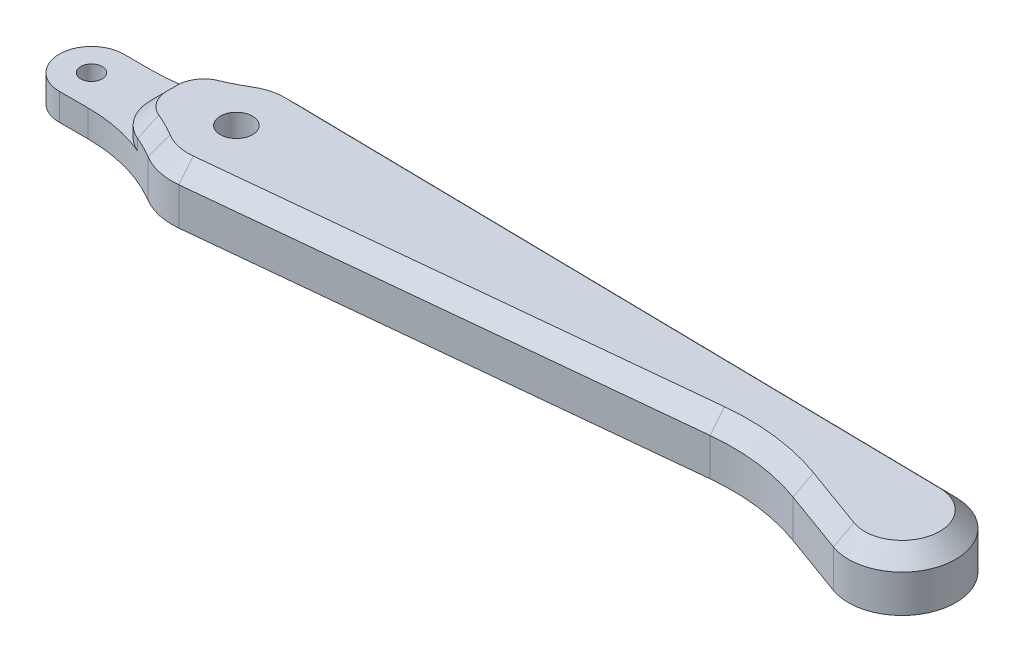
ISO-10303-21;
HEADER;
FILE_DESCRIPTION(('STEP AP214'),'2;1');
FILE_NAME('part.step','',(''),(''),'','','');
FILE_SCHEMA(('AUTOMOTIVE_DESIGN { 1 0 10303 214 1 1 1 1 }'));
ENDSEC;
DATA;
#1=APPLICATION_CONTEXT('core data for automotive mechanical design processes');
#2=APPLICATION_PROTOCOL_DEFINITION('international standard','automotive_design',2000,#1);
#3=PRODUCT_CONTEXT('',#1,'mechanical');
#4=PRODUCT('Part','Part','',(#3));
#5=PRODUCT_RELATED_PRODUCT_CATEGORY('part','',(#4));
#6=PRODUCT_DEFINITION_FORMATION('','',#4);
#7=PRODUCT_DEFINITION_CONTEXT('part definition',#1,'design');
#8=PRODUCT_DEFINITION('design','',#6,#7);
#9=PRODUCT_DEFINITION_SHAPE('','',#8);
#10=(LENGTH_UNIT() NAMED_UNIT(*) SI_UNIT(.MILLI.,.METRE.));
#11=(NAMED_UNIT(*) PLANE_ANGLE_UNIT() SI_UNIT($,.RADIAN.));
#12=(NAMED_UNIT(*) SI_UNIT($,.STERADIAN.) SOLID_ANGLE_UNIT());
#13=UNCERTAINTY_MEASURE_WITH_UNIT(LENGTH_MEASURE(1.E-05),#10,'distance_accuracy_value','');
#14=(GEOMETRIC_REPRESENTATION_CONTEXT(3) GLOBAL_UNCERTAINTY_ASSIGNED_CONTEXT((#13)) GLOBAL_UNIT_ASSIGNED_CONTEXT((#10,
#11,#12)) REPRESENTATION_CONTEXT('',''));
#15=CARTESIAN_POINT('',(0.,0.,0.));
#16=DIRECTION('',(0.,0.,1.));
#17=DIRECTION('',(1.,0.,0.));
#18=AXIS2_PLACEMENT_3D('',#15,#16,#17);
#19=CARTESIAN_POINT('',(-13.5,5.,0.));
#20=DIRECTION('',(0.,-1.,0.));
#21=DIRECTION('',(0.,0.,-1.));
#22=AXIS2_PLACEMENT_3D('',#19,#20,#21);
#23=CYLINDRICAL_SURFACE('',#22,3.);
#24=CARTESIAN_POINT('',(-13.5,2.5,0.));
#25=DIRECTION('',(0.,1.,0.));
#26=DIRECTION('',(0.,0.,1.));
#27=AXIS2_PLACEMENT_3D('',#24,#25,#26);
#28=CIRCLE('',#27,3.);
#29=CARTESIAN_POINT('',(-13.5,2.5,-3.));
#30=VERTEX_POINT('',#29);
#31=CARTESIAN_POINT('',(-13.5,2.5,3.));
#32=VERTEX_POINT('',#31);
#33=EDGE_CURVE('E194',#30,#32,#28,.T.);
#34=ORIENTED_EDGE('',*,*,#33,.F.);
#35=DIRECTION('',(0.,-1.,0.));
#36=VECTOR('',#35,1.);
#37=CARTESIAN_POINT('',(-13.5,5.,-3.));
#38=LINE('',#37,#36);
#39=CARTESIAN_POINT('',(-13.5,0.,-3.));
#40=VERTEX_POINT('',#39);
#41=EDGE_CURVE('E209',#30,#40,#38,.T.);
#42=ORIENTED_EDGE('',*,*,#41,.T.);
#43=CARTESIAN_POINT('',(-13.5,0.,0.));
#44=DIRECTION('',(0.,1.,0.));
#45=DIRECTION('',(0.,0.,1.));
#46=AXIS2_PLACEMENT_3D('',#43,#44,#45);
#47=CIRCLE('',#46,3.);
#48=CARTESIAN_POINT('',(-13.5,0.,3.));
#49=VERTEX_POINT('',#48);
#50=EDGE_CURVE('E396',#40,#49,#47,.T.);
#51=ORIENTED_EDGE('',*,*,#50,.T.);
#52=DIRECTION('',(0.,-1.,0.));
#53=VECTOR('',#52,1.);
#54=CARTESIAN_POINT('',(-13.5,5.,3.));
#55=LINE('',#54,#53);
#56=EDGE_CURVE('E211',#32,#49,#55,.T.);
#57=ORIENTED_EDGE('',*,*,#56,.F.);
#58=EDGE_LOOP('',(#34,#42,#51,#57));
#59=FACE_BOUND('',#58,.T.);
#60=ADVANCED_FACE('F41',(#59),#23,.T.);
#61=CARTESIAN_POINT('',(-13.5,5.,0.));
#62=DIRECTION('',(0.,-1.,0.));
#63=DIRECTION('',(0.,0.,-1.));
#64=AXIS2_PLACEMENT_3D('',#61,#62,#63);
#65=CYLINDRICAL_SURFACE('',#64,1.);
#66=CARTESIAN_POINT('',(-13.5,0.,0.));
#67=DIRECTION('',(0.,1.,0.));
#68=DIRECTION('',(0.,0.,1.));
#69=AXIS2_PLACEMENT_3D('',#66,#67,#68);
#70=CIRCLE('',#69,1.);
#71=CARTESIAN_POINT('',(-13.5,0.,1.));
#72=VERTEX_POINT('',#71);
#73=EDGE_CURVE('E240',#72,#72,#70,.T.);
#74=ORIENTED_EDGE('',*,*,#73,.F.);
#75=EDGE_LOOP('',(#74));
#76=FACE_BOUND('',#75,.T.);
#77=CARTESIAN_POINT('',(-13.5,2.5,0.));
#78=DIRECTION('',(0.,1.,0.));
#79=DIRECTION('',(0.,0.,1.));
#80=AXIS2_PLACEMENT_3D('',#77,#78,#79);
#81=CIRCLE('',#80,1.);
#82=CARTESIAN_POINT('',(-13.5,2.5,1.));
#83=VERTEX_POINT('',#82);
#84=EDGE_CURVE('E202',#83,#83,#81,.T.);
#85=ORIENTED_EDGE('',*,*,#84,.T.);
#86=EDGE_LOOP('',(#85));
#87=FACE_BOUND('',#86,.T.);
#88=ADVANCED_FACE('F494',(#76,#87),#65,.F.);
#89=CARTESIAN_POINT('',(0.,5.,0.));
#90=DIRECTION('',(0.,1.,0.));
#91=DIRECTION('',(0.,0.,1.));
#92=AXIS2_PLACEMENT_3D('',#89,#90,#91);
#93=PLANE('',#92);
#94=DIRECTION('',(0.,0.,1.));
#95=VECTOR('',#94,1.);
#96=CARTESIAN_POINT('',(-6.,5.,0.465275115225112));
#97=LINE('',#96,#95);
#98=CARTESIAN_POINT('',(-6.,5.,-0.465275115225112));
#99=VERTEX_POINT('',#98);
#100=CARTESIAN_POINT('',(-6.,5.,0.465275115225112));
#101=VERTEX_POINT('',#100);
#102=EDGE_CURVE('E289',#99,#101,#97,.T.);
#103=ORIENTED_EDGE('',*,*,#102,.T.);
#104=CARTESIAN_POINT('',(-3.5,5.,0.465275115225112));
#105=DIRECTION('',(0.,1.,0.));
#106=DIRECTION('',(0.,0.,1.));
#107=AXIS2_PLACEMENT_3D('',#104,#105,#106);
#108=CIRCLE('',#107,2.5);
#109=CARTESIAN_POINT('',(-4.46271760873579,5.,2.77247575795865));
#110=VERTEX_POINT('',#109);
#111=EDGE_CURVE('E293',#101,#110,#108,.T.);
#112=ORIENTED_EDGE('',*,*,#111,.T.);
#113=CARTESIAN_POINT('',(-10.816653826392,5.,18.));
#114=DIRECTION('',(0.,1.,0.));
#115=DIRECTION('',(0.,0.,1.));
#116=AXIS2_PLACEMENT_3D('',#113,#114,#115);
#117=CIRCLE('',#116,16.5);
#118=CARTESIAN_POINT('',(-2.31785439136971,5.,3.85714285714286));
#119=VERTEX_POINT('',#118);
#120=EDGE_CURVE('E291',#110,#119,#117,.F.);
#121=ORIENTED_EDGE('',*,*,#120,.T.);
#122=CARTESIAN_POINT('',(0.,5.,0.));
#123=DIRECTION('',(0.,1.,0.));
#124=DIRECTION('',(0.,0.,1.));
#125=AXIS2_PLACEMENT_3D('',#122,#123,#124);
#126=CIRCLE('',#125,4.5);
#127=CARTESIAN_POINT('',(0.45,5.,4.47744346697979));
#128=VERTEX_POINT('',#127);
#129=EDGE_CURVE('E287',#119,#128,#126,.T.);
#130=ORIENTED_EDGE('',*,*,#129,.T.);
#131=DIRECTION('',(0.99498743710662,0.,-0.1));
#132=VECTOR('',#131,1.);
#133=CARTESIAN_POINT('',(45.408314025328,5.,-0.0410371035955315));
#134=LINE('',#133,#132);
#135=CARTESIAN_POINT('',(45.408314025328,5.,-0.041037103595535));
#136=VERTEX_POINT('',#135);
#137=EDGE_CURVE('E283',#128,#136,#134,.T.);
#138=ORIENTED_EDGE('',*,*,#137,.T.);
#139=CARTESIAN_POINT('',(47.558314025328,5.,21.3511927941968));
#140=DIRECTION('',(0.,1.,0.));
#141=DIRECTION('',(0.,0.,1.));
#142=AXIS2_PLACEMENT_3D('',#139,#140,#141);
#143=CIRCLE('',#142,21.5);
#144=CARTESIAN_POINT('',(54.9023890577915,5.,1.14439784998199));
#145=VERTEX_POINT('',#144);
#146=EDGE_CURVE('E279',#136,#145,#143,.F.);
#147=ORIENTED_EDGE('',*,*,#146,.T.);
#148=DIRECTION('',(0.939850927637898,0.,0.341584885230865));
#149=VECTOR('',#148,1.);
#150=CARTESIAN_POINT('',(60.804452901692,5.,3.28947824673263));
#151=LINE('',#150,#149);
#152=CARTESIAN_POINT('',(60.804452901692,5.,3.28947824673264));
#153=VERTEX_POINT('',#152);
#154=EDGE_CURVE('E275',#145,#153,#151,.T.);
#155=ORIENTED_EDGE('',*,*,#154,.T.);
#156=CARTESIAN_POINT('',(62.,5.,0.));
#157=DIRECTION('',(0.,1.,0.));
#158=DIRECTION('',(0.,0.,1.));
#159=AXIS2_PLACEMENT_3D('',#156,#157,#158);
#160=CIRCLE('',#159,3.5);
#161=CARTESIAN_POINT('',(62.0564512737569,5.,-3.49954472091603));
#162=VERTEX_POINT('',#161);
#163=EDGE_CURVE('E271',#153,#162,#160,.T.);
#164=ORIENTED_EDGE('',*,*,#163,.T.);
#165=DIRECTION('',(-0.999869920261722,0.,-0.0161289353591094));
#166=VECTOR('',#165,1.);
#167=CARTESIAN_POINT('',(0.0810697548560727,5.,-4.49927168751269));
#168=LINE('',#167,#166);
#169=CARTESIAN_POINT('',(0.0789473441964594,5.,-4.49930592419052));
#170=VERTEX_POINT('',#169);
#171=EDGE_CURVE('E273',#162,#170,#168,.T.);
#172=ORIENTED_EDGE('',*,*,#171,.T.);
#173=CARTESIAN_POINT('',(0.,5.,0.));
#174=DIRECTION('',(0.,1.,0.));
#175=DIRECTION('',(0.,0.,1.));
#176=AXIS2_PLACEMENT_3D('',#173,#174,#175);
#177=CIRCLE('',#176,4.5);
#178=CARTESIAN_POINT('',(-2.31785439136971,5.,-3.85714285714286));
#179=VERTEX_POINT('',#178);
#180=EDGE_CURVE('E277',#170,#179,#177,.T.);
#181=ORIENTED_EDGE('',*,*,#180,.T.);
#182=CARTESIAN_POINT('',(-10.816653826392,5.,-18.));
#183=DIRECTION('',(0.,1.,0.));
#184=DIRECTION('',(0.,0.,1.));
#185=AXIS2_PLACEMENT_3D('',#182,#183,#184);
#186=CIRCLE('',#185,16.5);
#187=CARTESIAN_POINT('',(-4.46271760873578,5.,-2.77247575795865));
#188=VERTEX_POINT('',#187);
#189=EDGE_CURVE('E281',#179,#188,#186,.F.);
#190=ORIENTED_EDGE('',*,*,#189,.T.);
#191=CARTESIAN_POINT('',(-3.5,5.,-0.465275115225112));
#192=DIRECTION('',(0.,1.,0.));
#193=DIRECTION('',(0.,0.,1.));
#194=AXIS2_PLACEMENT_3D('',#191,#192,#193);
#195=CIRCLE('',#194,2.5);
#196=EDGE_CURVE('E285',#188,#99,#195,.T.);
#197=ORIENTED_EDGE('',*,*,#196,.T.);
#198=EDGE_LOOP('',(#103,#112,#121,#130,#138,#147,#155,#164,#172,#181,#190,#197));
#199=FACE_BOUND('',#198,.T.);
#200=CARTESIAN_POINT('',(0.,5.,0.));
#201=DIRECTION('',(0.,1.,0.));
#202=DIRECTION('',(0.,0.,1.));
#203=AXIS2_PLACEMENT_3D('',#200,#201,#202);
#204=CIRCLE('',#203,1.5);
#205=CARTESIAN_POINT('',(0.,5.,1.5));
#206=VERTEX_POINT('',#205);
#207=EDGE_CURVE('E426',#206,#206,#204,.T.);
#208=ORIENTED_EDGE('',*,*,#207,.F.);
#209=EDGE_LOOP('',(#208));
#210=FACE_BOUND('',#209,.T.);
#211=ADVANCED_FACE('F499',(#199,#210),#93,.T.);
#212=CARTESIAN_POINT('',(0.,0.,0.));
#213=DIRECTION('',(0.,1.,0.));
#214=DIRECTION('',(0.,0.,1.));
#215=AXIS2_PLACEMENT_3D('',#212,#213,#214);
#216=PLANE('',#215);
#217=CARTESIAN_POINT('',(0.,0.,0.));
#218=DIRECTION('',(0.,1.,0.));
#219=DIRECTION('',(0.,0.,1.));
#220=AXIS2_PLACEMENT_3D('',#217,#218,#219);
#221=CIRCLE('',#220,6.);
#222=CARTESIAN_POINT('',(-3.09047252182628,0.,5.14285714285715));
#223=VERTEX_POINT('',#222);
#224=CARTESIAN_POINT('',(0.6,0.,5.96992462263972));
#225=VERTEX_POINT('',#224);
#226=EDGE_CURVE('E386',#223,#225,#221,.T.);
#227=ORIENTED_EDGE('',*,*,#226,.F.);
#228=CARTESIAN_POINT('',(-10.816653826392,0.,18.));
#229=DIRECTION('',(0.,1.,0.));
#230=DIRECTION('',(0.,0.,1.));
#231=AXIS2_PLACEMENT_3D('',#228,#229,#230);
#232=CIRCLE('',#231,15.);
#233=CARTESIAN_POINT('',(-10.816653826392,0.,3.));
#234=VERTEX_POINT('',#233);
#235=EDGE_CURVE('E249',#223,#234,#232,.T.);
#236=ORIENTED_EDGE('',*,*,#235,.T.);
#237=DIRECTION('',(1.,0.,0.));
#238=VECTOR('',#237,1.);
#239=CARTESIAN_POINT('',(-13.5,0.,3.));
#240=LINE('',#239,#238);
#241=EDGE_CURVE('E221',#49,#234,#240,.T.);
#242=ORIENTED_EDGE('',*,*,#241,.F.);
#243=ORIENTED_EDGE('',*,*,#50,.F.);
#244=DIRECTION('',(-1.,0.,0.));
#245=VECTOR('',#244,1.);
#246=CARTESIAN_POINT('',(-13.5,0.,-3.));
#247=LINE('',#246,#245);
#248=CARTESIAN_POINT('',(-10.816653826392,0.,-3.));
#249=VERTEX_POINT('',#248);
#250=EDGE_CURVE('E216',#249,#40,#247,.T.);
#251=ORIENTED_EDGE('',*,*,#250,.F.);
#252=CARTESIAN_POINT('',(-10.816653826392,0.,-18.));
#253=DIRECTION('',(0.,1.,0.));
#254=DIRECTION('',(0.,0.,1.));
#255=AXIS2_PLACEMENT_3D('',#252,#253,#254);
#256=CIRCLE('',#255,15.);
#257=CARTESIAN_POINT('',(-3.09047252182628,0.,-5.14285714285714));
#258=VERTEX_POINT('',#257);
#259=EDGE_CURVE('E254',#249,#258,#256,.T.);
#260=ORIENTED_EDGE('',*,*,#259,.T.);
#261=CARTESIAN_POINT('',(0.,0.,0.));
#262=DIRECTION('',(0.,1.,0.));
#263=DIRECTION('',(0.,0.,1.));
#264=AXIS2_PLACEMENT_3D('',#261,#262,#263);
#265=CIRCLE('',#264,6.);
#266=CARTESIAN_POINT('',(0.105263157894737,0.,-5.99907656790527));
#267=VERTEX_POINT('',#266);
#268=EDGE_CURVE('E392',#267,#258,#265,.T.);
#269=ORIENTED_EDGE('',*,*,#268,.F.);
#270=DIRECTION('',(-0.999869920261722,0.,-0.0161289353591094));
#271=VECTOR('',#270,1.);
#272=CARTESIAN_POINT('',(0.105263157894737,0.,-5.99907656790527));
#273=LINE('',#272,#271);
#274=CARTESIAN_POINT('',(62.0806446767956,0.,-4.99934960130861));
#275=VERTEX_POINT('',#274);
#276=EDGE_CURVE('E384',#275,#267,#273,.T.);
#277=ORIENTED_EDGE('',*,*,#276,.F.);
#278=CARTESIAN_POINT('',(62.,0.,0.));
#279=DIRECTION('',(0.,1.,0.));
#280=DIRECTION('',(0.,0.,1.));
#281=AXIS2_PLACEMENT_3D('',#278,#279,#280);
#282=CIRCLE('',#281,5.);
#283=CARTESIAN_POINT('',(60.2920755738457,0.,4.69925463818949));
#284=VERTEX_POINT('',#283);
#285=EDGE_CURVE('E381',#284,#275,#282,.T.);
#286=ORIENTED_EDGE('',*,*,#285,.F.);
#287=DIRECTION('',(0.939850927637898,0.,0.341584885230865));
#288=VECTOR('',#287,1.);
#289=CARTESIAN_POINT('',(50.1,0.,0.99498743710662));
#290=LINE('',#289,#288);
#291=CARTESIAN_POINT('',(54.3900117299452,0.,2.55417424143884));
#292=VERTEX_POINT('',#291);
#293=EDGE_CURVE('E375',#292,#284,#290,.T.);
#294=ORIENTED_EDGE('',*,*,#293,.F.);
#295=CARTESIAN_POINT('',(47.558314025328,0.,21.3511927941968));
#296=DIRECTION('',(0.,1.,0.));
#297=DIRECTION('',(0.,0.,1.));
#298=AXIS2_PLACEMENT_3D('',#295,#296,#297);
#299=CIRCLE('',#298,20.);
#300=CARTESIAN_POINT('',(45.558314025328,0.,1.4514440520644));
#301=VERTEX_POINT('',#300);
#302=EDGE_CURVE('E235',#292,#301,#299,.T.);
#303=ORIENTED_EDGE('',*,*,#302,.T.);
#304=DIRECTION('',(0.99498743710662,0.,-0.1));
#305=VECTOR('',#304,1.);
#306=CARTESIAN_POINT('',(0.6,0.,5.96992462263972));
#307=LINE('',#306,#305);
#308=EDGE_CURVE('E382',#225,#301,#307,.T.);
#309=ORIENTED_EDGE('',*,*,#308,.F.);
#310=EDGE_LOOP('',(#227,#236,#242,#243,#251,#260,#269,#277,#286,#294,#303,#309));
#311=FACE_BOUND('',#310,.T.);
#312=CARTESIAN_POINT('',(0.,0.,0.));
#313=DIRECTION('',(0.,1.,0.));
#314=DIRECTION('',(0.,0.,1.));
#315=AXIS2_PLACEMENT_3D('',#312,#313,#314);
#316=CIRCLE('',#315,1.5);
#317=CARTESIAN_POINT('',(0.,0.,1.5));
#318=VERTEX_POINT('',#317);
#319=EDGE_CURVE('E425',#318,#318,#316,.T.);
#320=ORIENTED_EDGE('',*,*,#319,.T.);
#321=EDGE_LOOP('',(#320));
#322=FACE_BOUND('',#321,.T.);
#323=ORIENTED_EDGE('',*,*,#73,.T.);
#324=EDGE_LOOP('',(#323));
#325=FACE_BOUND('',#324,.T.);
#326=ADVANCED_FACE('F377',(#311,#322,#325),#216,.F.);
#327=CARTESIAN_POINT('',(0.,5.,0.));
#328=DIRECTION('',(0.,-1.,0.));
#329=DIRECTION('',(0.,0.,-1.));
#330=AXIS2_PLACEMENT_3D('',#327,#328,#329);
#331=CYLINDRICAL_SURFACE('',#330,6.);
#332=DIRECTION('',(0.,-1.,0.));
#333=VECTOR('',#332,1.);
#334=CARTESIAN_POINT('',(0.6,5.,5.96992462263972));
#335=LINE('',#334,#333);
#336=CARTESIAN_POINT('',(0.6,3.50000000000001,5.96992462263972));
#337=VERTEX_POINT('',#336);
#338=EDGE_CURVE('E228',#337,#225,#335,.T.);
#339=ORIENTED_EDGE('',*,*,#338,.F.);
#340=CARTESIAN_POINT('',(0.,3.50000000000001,0.));
#341=DIRECTION('',(0.,1.,0.));
#342=DIRECTION('',(0.,0.,1.));
#343=AXIS2_PLACEMENT_3D('',#340,#341,#342);
#344=CIRCLE('',#343,6.);
#345=CARTESIAN_POINT('',(-3.09047252182628,3.50000000000001,5.14285714285715));
#346=VERTEX_POINT('',#345);
#347=EDGE_CURVE('E303',#337,#346,#344,.F.);
#348=ORIENTED_EDGE('',*,*,#347,.T.);
#349=DIRECTION('',(0.,-1.,0.));
#350=VECTOR('',#349,1.);
#351=CARTESIAN_POINT('',(-3.09047252182628,5.,5.14285714285715));
#352=LINE('',#351,#350);
#353=EDGE_CURVE('E237',#346,#223,#352,.T.);
#354=ORIENTED_EDGE('',*,*,#353,.T.);
#355=ORIENTED_EDGE('',*,*,#226,.T.);
#356=EDGE_LOOP('',(#339,#348,#354,#355));
#357=FACE_BOUND('',#356,.T.);
#358=ADVANCED_FACE('F433',(#357),#331,.T.);
#359=CARTESIAN_POINT('',(0.6,5.,5.96992462263972));
#360=DIRECTION('',(-0.1,0.,-0.99498743710662));
#361=DIRECTION('',(-0.99498743710662,0.,0.1));
#362=AXIS2_PLACEMENT_3D('',#359,#360,#361);
#363=PLANE('',#362);
#364=DIRECTION('',(0.,-1.,0.));
#365=VECTOR('',#364,1.);
#366=CARTESIAN_POINT('',(45.558314025328,5.,1.4514440520644));
#367=LINE('',#366,#365);
#368=CARTESIAN_POINT('',(45.558314025328,3.50000000000001,1.4514440520644));
#369=VERTEX_POINT('',#368);
#370=EDGE_CURVE('E232',#301,#369,#367,.F.);
#371=ORIENTED_EDGE('',*,*,#370,.T.);
#372=DIRECTION('',(-0.99498743710662,0.,0.1));
#373=VECTOR('',#372,1.);
#374=CARTESIAN_POINT('',(0.6,3.50000000000001,5.96992462263972));
#375=LINE('',#374,#373);
#376=EDGE_CURVE('E307',#369,#337,#375,.T.);
#377=ORIENTED_EDGE('',*,*,#376,.T.);
#378=ORIENTED_EDGE('',*,*,#338,.T.);
#379=ORIENTED_EDGE('',*,*,#308,.T.);
#380=EDGE_LOOP('',(#371,#377,#378,#379));
#381=FACE_BOUND('',#380,.T.);
#382=ADVANCED_FACE('F436',(#381),#363,.F.);
#383=CARTESIAN_POINT('',(50.1,5.,0.99498743710662));
#384=DIRECTION('',(0.341584885230865,0.,-0.939850927637898));
#385=DIRECTION('',(-0.939850927637898,0.,-0.341584885230865));
#386=AXIS2_PLACEMENT_3D('',#383,#384,#385);
#387=PLANE('',#386);
#388=DIRECTION('',(0.,-1.,0.));
#389=VECTOR('',#388,1.);
#390=CARTESIAN_POINT('',(60.2920755738457,5.,4.69925463818949));
#391=LINE('',#390,#389);
#392=CARTESIAN_POINT('',(60.2920755738457,3.50000000000001,4.69925463818949));
#393=VERTEX_POINT('',#392);
#394=EDGE_CURVE('E226',#393,#284,#391,.T.);
#395=ORIENTED_EDGE('',*,*,#394,.F.);
#396=DIRECTION('',(-0.939850927637898,0.,-0.341584885230865));
#397=VECTOR('',#396,1.);
#398=CARTESIAN_POINT('',(54.3900117299452,3.50000000000001,2.55417424143884));
#399=LINE('',#398,#397);
#400=CARTESIAN_POINT('',(54.3900117299452,3.50000000000001,2.55417424143884));
#401=VERTEX_POINT('',#400);
#402=EDGE_CURVE('E315',#393,#401,#399,.T.);
#403=ORIENTED_EDGE('',*,*,#402,.T.);
#404=DIRECTION('',(0.,-1.,0.));
#405=VECTOR('',#404,1.);
#406=CARTESIAN_POINT('',(54.3900117299452,0.,2.55417424143884));
#407=LINE('',#406,#405);
#408=EDGE_CURVE('E230',#401,#292,#407,.T.);
#409=ORIENTED_EDGE('',*,*,#408,.T.);
#410=ORIENTED_EDGE('',*,*,#293,.T.);
#411=EDGE_LOOP('',(#395,#403,#409,#410));
#412=FACE_BOUND('',#411,.T.);
#413=ADVANCED_FACE('F364',(#412),#387,.F.);
#414=CARTESIAN_POINT('',(62.,5.,0.));
#415=DIRECTION('',(0.,-1.,0.));
#416=DIRECTION('',(0.,0.,-1.));
#417=AXIS2_PLACEMENT_3D('',#414,#415,#416);
#418=CYLINDRICAL_SURFACE('',#417,5.);
#419=DIRECTION('',(0.,-1.,0.));
#420=VECTOR('',#419,1.);
#421=CARTESIAN_POINT('',(62.0806446767956,5.,-4.99934960130861));
#422=LINE('',#421,#420);
#423=CARTESIAN_POINT('',(62.0806446767956,3.50000000000001,-4.99934960130861));
#424=VERTEX_POINT('',#423);
#425=EDGE_CURVE('E219',#424,#275,#422,.T.);
#426=ORIENTED_EDGE('',*,*,#425,.F.);
#427=CARTESIAN_POINT('',(62.,3.50000000000001,0.));
#428=DIRECTION('',(0.,1.,0.));
#429=DIRECTION('',(0.,0.,1.));
#430=AXIS2_PLACEMENT_3D('',#427,#428,#429);
#431=CIRCLE('',#430,5.);
#432=EDGE_CURVE('E11',#424,#393,#431,.F.);
#433=ORIENTED_EDGE('',*,*,#432,.T.);
#434=ORIENTED_EDGE('',*,*,#394,.T.);
#435=ORIENTED_EDGE('',*,*,#285,.T.);
#436=EDGE_LOOP('',(#426,#433,#434,#435));
#437=FACE_BOUND('',#436,.T.);
#438=ADVANCED_FACE('F484',(#437),#418,.T.);
#439=CARTESIAN_POINT('',(0.105263157894737,5.,-5.99907656790527));
#440=DIRECTION('',(-0.0161289353591094,0.,0.999869920261722));
#441=DIRECTION('',(0.999869920261722,0.,0.0161289353591094));
#442=AXIS2_PLACEMENT_3D('',#439,#440,#441);
#443=PLANE('',#442);
#444=DIRECTION('',(0.,-1.,0.));
#445=VECTOR('',#444,1.);
#446=CARTESIAN_POINT('',(0.105263157894737,5.,-5.99907656790527));
#447=LINE('',#446,#445);
#448=CARTESIAN_POINT('',(0.105263157894737,3.50000000000001,-5.99907656790527));
#449=VERTEX_POINT('',#448);
#450=EDGE_CURVE('E217',#449,#267,#447,.T.);
#451=ORIENTED_EDGE('',*,*,#450,.F.);
#452=DIRECTION('',(0.999869920261722,0.,0.0161289353591094));
#453=VECTOR('',#452,1.);
#454=CARTESIAN_POINT('',(62.0806446767956,3.50000000000001,-4.99934960130861));
#455=LINE('',#454,#453);
#456=EDGE_CURVE('E51',#449,#424,#455,.T.);
#457=ORIENTED_EDGE('',*,*,#456,.T.);
#458=ORIENTED_EDGE('',*,*,#425,.T.);
#459=ORIENTED_EDGE('',*,*,#276,.T.);
#460=EDGE_LOOP('',(#451,#457,#458,#459));
#461=FACE_BOUND('',#460,.T.);
#462=ADVANCED_FACE('F482',(#461),#443,.F.);
#463=CARTESIAN_POINT('',(0.,5.,0.));
#464=DIRECTION('',(0.,-1.,0.));
#465=DIRECTION('',(0.,0.,-1.));
#466=AXIS2_PLACEMENT_3D('',#463,#464,#465);
#467=CYLINDRICAL_SURFACE('',#466,6.);
#468=DIRECTION('',(0.,-1.,0.));
#469=VECTOR('',#468,1.);
#470=CARTESIAN_POINT('',(-3.09047252182628,5.,-5.14285714285714));
#471=LINE('',#470,#469);
#472=CARTESIAN_POINT('',(-3.09047252182628,3.50000000000001,-5.14285714285714));
#473=VERTEX_POINT('',#472);
#474=EDGE_CURVE('E246',#258,#473,#471,.F.);
#475=ORIENTED_EDGE('',*,*,#474,.T.);
#476=CARTESIAN_POINT('',(0.,3.50000000000001,0.));
#477=DIRECTION('',(0.,1.,0.));
#478=DIRECTION('',(0.,0.,1.));
#479=AXIS2_PLACEMENT_3D('',#476,#477,#478);
#480=CIRCLE('',#479,6.);
#481=EDGE_CURVE('E313',#473,#449,#480,.F.);
#482=ORIENTED_EDGE('',*,*,#481,.T.);
#483=ORIENTED_EDGE('',*,*,#450,.T.);
#484=ORIENTED_EDGE('',*,*,#268,.T.);
#485=EDGE_LOOP('',(#475,#482,#483,#484));
#486=FACE_BOUND('',#485,.T.);
#487=ADVANCED_FACE('F481',(#486),#467,.T.);
#488=CARTESIAN_POINT('',(-13.5,5.,-3.));
#489=DIRECTION('',(0.,0.,1.));
#490=DIRECTION('',(1.,0.,0.));
#491=AXIS2_PLACEMENT_3D('',#488,#489,#490);
#492=PLANE('',#491);
#493=DIRECTION('',(-1.,0.,0.));
#494=VECTOR('',#493,1.);
#495=CARTESIAN_POINT('',(-13.5,2.5,-3.));
#496=LINE('',#495,#494);
#497=CARTESIAN_POINT('',(-10.816653826392,2.5,-3.));
#498=VERTEX_POINT('',#497);
#499=EDGE_CURVE('E190',#498,#30,#496,.T.);
#500=ORIENTED_EDGE('',*,*,#499,.F.);
#501=DIRECTION('',(0.,1.,0.));
#502=VECTOR('',#501,1.);
#503=CARTESIAN_POINT('',(-10.816653826392,0.,-3.));
#504=LINE('',#503,#502);
#505=EDGE_CURVE('E244',#498,#249,#504,.F.);
#506=ORIENTED_EDGE('',*,*,#505,.T.);
#507=ORIENTED_EDGE('',*,*,#250,.T.);
#508=ORIENTED_EDGE('',*,*,#41,.F.);
#509=EDGE_LOOP('',(#500,#506,#507,#508));
#510=FACE_BOUND('',#509,.T.);
#511=ADVANCED_FACE('F214',(#510),#492,.F.);
#512=CARTESIAN_POINT('',(-13.5,5.,3.));
#513=DIRECTION('',(0.,0.,-1.));
#514=DIRECTION('',(-1.,0.,0.));
#515=AXIS2_PLACEMENT_3D('',#512,#513,#514);
#516=PLANE('',#515);
#517=ORIENTED_EDGE('',*,*,#241,.T.);
#518=DIRECTION('',(0.,1.,0.));
#519=VECTOR('',#518,1.);
#520=CARTESIAN_POINT('',(-10.816653826392,5.,3.));
#521=LINE('',#520,#519);
#522=CARTESIAN_POINT('',(-10.816653826392,2.5,3.));
#523=VERTEX_POINT('',#522);
#524=EDGE_CURVE('E242',#234,#523,#521,.T.);
#525=ORIENTED_EDGE('',*,*,#524,.T.);
#526=DIRECTION('',(1.,0.,0.));
#527=VECTOR('',#526,1.);
#528=CARTESIAN_POINT('',(-13.5,2.5,3.));
#529=LINE('',#528,#527);
#530=EDGE_CURVE('E212',#32,#523,#529,.T.);
#531=ORIENTED_EDGE('',*,*,#530,.F.);
#532=ORIENTED_EDGE('',*,*,#56,.T.);
#533=EDGE_LOOP('',(#517,#525,#531,#532));
#534=FACE_BOUND('',#533,.T.);
#535=ADVANCED_FACE('F401',(#534),#516,.F.);
#536=CARTESIAN_POINT('',(0.,5.,0.));
#537=DIRECTION('',(0.,-1.,0.));
#538=DIRECTION('',(0.,0.,-1.));
#539=AXIS2_PLACEMENT_3D('',#536,#537,#538);
#540=CYLINDRICAL_SURFACE('',#539,1.5);
#541=ORIENTED_EDGE('',*,*,#207,.T.);
#542=EDGE_LOOP('',(#541));
#543=FACE_BOUND('',#542,.T.);
#544=ORIENTED_EDGE('',*,*,#319,.F.);
#545=EDGE_LOOP('',(#544));
#546=FACE_BOUND('',#545,.T.);
#547=ADVANCED_FACE('F524',(#543,#546),#540,.F.);
#548=CARTESIAN_POINT('',(47.558314025328,5.,21.3511927941968));
#549=DIRECTION('',(0.,1.,0.));
#550=DIRECTION('',(0.,0.,1.));
#551=AXIS2_PLACEMENT_3D('',#548,#549,#550);
#552=CYLINDRICAL_SURFACE('',#551,20.);
#553=ORIENTED_EDGE('',*,*,#408,.F.);
#554=CARTESIAN_POINT('',(47.558314025328,3.50000000000001,21.3511927941968));
#555=DIRECTION('',(0.,1.,0.));
#556=DIRECTION('',(0.,0.,1.));
#557=AXIS2_PLACEMENT_3D('',#554,#555,#556);
#558=CIRCLE('',#557,20.);
#559=EDGE_CURVE('E311',#401,#369,#558,.T.);
#560=ORIENTED_EDGE('',*,*,#559,.T.);
#561=ORIENTED_EDGE('',*,*,#370,.F.);
#562=ORIENTED_EDGE('',*,*,#302,.F.);
#563=EDGE_LOOP('',(#553,#560,#561,#562));
#564=FACE_BOUND('',#563,.T.);
#565=ADVANCED_FACE('F368',(#564),#552,.F.);
#566=CARTESIAN_POINT('',(-7.5,2.5,-3.));
#567=DIRECTION('',(1.,0.,0.));
#568=DIRECTION('',(0.,0.,-1.));
#569=AXIS2_PLACEMENT_3D('',#566,#567,#568);
#570=PLANE('',#569);
#571=DIRECTION('',(0.,-1.,0.));
#572=VECTOR('',#571,1.);
#573=CARTESIAN_POINT('',(-7.5,2.5,0.465275115225112));
#574=LINE('',#573,#572);
#575=CARTESIAN_POINT('',(-7.5,2.5,0.465275115225112));
#576=VERTEX_POINT('',#575);
#577=CARTESIAN_POINT('',(-7.5,3.50000000000001,0.465275115225112));
#578=VERTEX_POINT('',#577);
#579=EDGE_CURVE('E257',#576,#578,#574,.F.);
#580=ORIENTED_EDGE('',*,*,#579,.T.);
#581=DIRECTION('',(0.,0.,-1.));
#582=VECTOR('',#581,1.);
#583=CARTESIAN_POINT('',(-7.5,3.50000000000001,-0.465275115225111));
#584=LINE('',#583,#582);
#585=CARTESIAN_POINT('',(-7.5,3.50000000000001,-0.465275115225111));
#586=VERTEX_POINT('',#585);
#587=EDGE_CURVE('E301',#578,#586,#584,.T.);
#588=ORIENTED_EDGE('',*,*,#587,.T.);
#589=DIRECTION('',(0.,-1.,0.));
#590=VECTOR('',#589,1.);
#591=CARTESIAN_POINT('',(-7.5,2.5,-0.465275115225111));
#592=LINE('',#591,#590);
#593=CARTESIAN_POINT('',(-7.5,2.5,-0.465275115225111));
#594=VERTEX_POINT('',#593);
#595=EDGE_CURVE('E260',#586,#594,#592,.T.);
#596=ORIENTED_EDGE('',*,*,#595,.T.);
#597=DIRECTION('',(0.,0.,-1.));
#598=VECTOR('',#597,1.);
#599=CARTESIAN_POINT('',(-7.5,2.5,-3.));
#600=LINE('',#599,#598);
#601=EDGE_CURVE('E203',#576,#594,#600,.T.);
#602=ORIENTED_EDGE('',*,*,#601,.F.);
#603=EDGE_LOOP('',(#580,#588,#596,#602));
#604=FACE_BOUND('',#603,.T.);
#605=ADVANCED_FACE('F416',(#604),#570,.F.);
#606=CARTESIAN_POINT('',(-13.5,2.5,0.));
#607=DIRECTION('',(0.,1.,0.));
#608=DIRECTION('',(0.,0.,1.));
#609=AXIS2_PLACEMENT_3D('',#606,#607,#608);
#610=PLANE('',#609);
#611=ORIENTED_EDGE('',*,*,#84,.F.);
#612=EDGE_LOOP('',(#611));
#613=FACE_BOUND('',#612,.T.);
#614=ORIENTED_EDGE('',*,*,#33,.T.);
#615=ORIENTED_EDGE('',*,*,#530,.T.);
#616=CARTESIAN_POINT('',(-10.816653826392,2.5,18.));
#617=DIRECTION('',(0.,1.,0.));
#618=DIRECTION('',(0.,0.,1.));
#619=AXIS2_PLACEMENT_3D('',#616,#617,#618);
#620=CIRCLE('',#619,15.);
#621=CARTESIAN_POINT('',(-5.04034817397726,2.5,4.15679614359877));
#622=VERTEX_POINT('',#621);
#623=EDGE_CURVE('E251',#523,#622,#620,.F.);
#624=ORIENTED_EDGE('',*,*,#623,.T.);
#625=CARTESIAN_POINT('',(-3.5,2.5,0.465275115225112));
#626=DIRECTION('',(0.,1.,0.));
#627=DIRECTION('',(0.,0.,1.));
#628=AXIS2_PLACEMENT_3D('',#625,#626,#627);
#629=CIRCLE('',#628,4.);
#630=EDGE_CURVE('E269',#622,#576,#629,.F.);
#631=ORIENTED_EDGE('',*,*,#630,.T.);
#632=ORIENTED_EDGE('',*,*,#601,.T.);
#633=CARTESIAN_POINT('',(-3.5,2.5,-0.465275115225112));
#634=DIRECTION('',(0.,1.,0.));
#635=DIRECTION('',(0.,0.,1.));
#636=AXIS2_PLACEMENT_3D('',#633,#634,#635);
#637=CIRCLE('',#636,4.);
#638=CARTESIAN_POINT('',(-5.04034817397726,2.5,-4.15679614359877));
#639=VERTEX_POINT('',#638);
#640=EDGE_CURVE('E267',#594,#639,#637,.F.);
#641=ORIENTED_EDGE('',*,*,#640,.T.);
#642=CARTESIAN_POINT('',(-10.816653826392,2.5,-18.));
#643=DIRECTION('',(0.,1.,0.));
#644=DIRECTION('',(0.,0.,1.));
#645=AXIS2_PLACEMENT_3D('',#642,#643,#644);
#646=CIRCLE('',#645,15.);
#647=EDGE_CURVE('E197',#639,#498,#646,.F.);
#648=ORIENTED_EDGE('',*,*,#647,.T.);
#649=ORIENTED_EDGE('',*,*,#499,.T.);
#650=EDGE_LOOP('',(#614,#615,#624,#631,#632,#641,#648,#649));
#651=FACE_BOUND('',#650,.T.);
#652=ADVANCED_FACE('F192',(#613,#651),#610,.T.);
#653=CARTESIAN_POINT('',(-10.816653826392,5.,18.));
#654=DIRECTION('',(0.,-1.,0.));
#655=DIRECTION('',(0.,0.,-1.));
#656=AXIS2_PLACEMENT_3D('',#653,#654,#655);
#657=CYLINDRICAL_SURFACE('',#656,15.);
#658=ORIENTED_EDGE('',*,*,#353,.F.);
#659=CARTESIAN_POINT('',(-10.816653826392,3.50000000000001,18.));
#660=DIRECTION('',(0.,1.,0.));
#661=DIRECTION('',(0.,0.,1.));
#662=AXIS2_PLACEMENT_3D('',#659,#660,#661);
#663=CIRCLE('',#662,15.);
#664=CARTESIAN_POINT('',(-5.04034817397726,3.50000000000001,4.15679614359877));
#665=VERTEX_POINT('',#664);
#666=EDGE_CURVE('E299',#346,#665,#663,.T.);
#667=ORIENTED_EDGE('',*,*,#666,.T.);
#668=DIRECTION('',(0.,-1.,0.));
#669=VECTOR('',#668,1.);
#670=CARTESIAN_POINT('',(-5.04034817397726,5.,4.15679614359877));
#671=LINE('',#670,#669);
#672=EDGE_CURVE('E265',#665,#622,#671,.T.);
#673=ORIENTED_EDGE('',*,*,#672,.T.);
#674=ORIENTED_EDGE('',*,*,#623,.F.);
#675=ORIENTED_EDGE('',*,*,#524,.F.);
#676=ORIENTED_EDGE('',*,*,#235,.F.);
#677=EDGE_LOOP('',(#658,#667,#673,#674,#675,#676));
#678=FACE_BOUND('',#677,.T.);
#679=ADVANCED_FACE('F406',(#678),#657,.F.);
#680=CARTESIAN_POINT('',(-10.816653826392,5.,-18.));
#681=DIRECTION('',(0.,-1.,0.));
#682=DIRECTION('',(0.,0.,-1.));
#683=AXIS2_PLACEMENT_3D('',#680,#681,#682);
#684=CYLINDRICAL_SURFACE('',#683,15.);
#685=DIRECTION('',(0.,-1.,0.));
#686=VECTOR('',#685,1.);
#687=CARTESIAN_POINT('',(-5.04034817397726,5.,-4.15679614359877));
#688=LINE('',#687,#686);
#689=CARTESIAN_POINT('',(-5.04034817397726,3.50000000000001,-4.15679614359877));
#690=VERTEX_POINT('',#689);
#691=EDGE_CURVE('E262',#639,#690,#688,.F.);
#692=ORIENTED_EDGE('',*,*,#691,.T.);
#693=CARTESIAN_POINT('',(-10.816653826392,3.50000000000001,-18.));
#694=DIRECTION('',(0.,1.,0.));
#695=DIRECTION('',(0.,0.,1.));
#696=AXIS2_PLACEMENT_3D('',#693,#694,#695);
#697=CIRCLE('',#696,15.);
#698=EDGE_CURVE('E309',#690,#473,#697,.T.);
#699=ORIENTED_EDGE('',*,*,#698,.T.);
#700=ORIENTED_EDGE('',*,*,#474,.F.);
#701=ORIENTED_EDGE('',*,*,#259,.F.);
#702=ORIENTED_EDGE('',*,*,#505,.F.);
#703=ORIENTED_EDGE('',*,*,#647,.F.);
#704=EDGE_LOOP('',(#692,#699,#700,#701,#702,#703));
#705=FACE_BOUND('',#704,.T.);
#706=ADVANCED_FACE('F470',(#705),#684,.F.);
#707=CARTESIAN_POINT('',(-3.5,5.,-0.465275115225112));
#708=DIRECTION('',(0.,-1.,0.));
#709=DIRECTION('',(0.,0.,-1.));
#710=AXIS2_PLACEMENT_3D('',#707,#708,#709);
#711=CYLINDRICAL_SURFACE('',#710,4.);
#712=ORIENTED_EDGE('',*,*,#595,.F.);
#713=CARTESIAN_POINT('',(-3.5,3.50000000000001,-0.465275115225112));
#714=DIRECTION('',(0.,1.,0.));
#715=DIRECTION('',(0.,0.,1.));
#716=AXIS2_PLACEMENT_3D('',#713,#714,#715);
#717=CIRCLE('',#716,4.);
#718=EDGE_CURVE('E305',#586,#690,#717,.F.);
#719=ORIENTED_EDGE('',*,*,#718,.T.);
#720=ORIENTED_EDGE('',*,*,#691,.F.);
#721=ORIENTED_EDGE('',*,*,#640,.F.);
#722=EDGE_LOOP('',(#712,#719,#720,#721));
#723=FACE_BOUND('',#722,.T.);
#724=ADVANCED_FACE('F467',(#723),#711,.T.);
#725=CARTESIAN_POINT('',(-3.5,5.,0.465275115225112));
#726=DIRECTION('',(0.,-1.,0.));
#727=DIRECTION('',(0.,0.,-1.));
#728=AXIS2_PLACEMENT_3D('',#725,#726,#727);
#729=CYLINDRICAL_SURFACE('',#728,4.);
#730=ORIENTED_EDGE('',*,*,#672,.F.);
#731=CARTESIAN_POINT('',(-3.5,3.50000000000001,0.465275115225112));
#732=DIRECTION('',(0.,1.,0.));
#733=DIRECTION('',(0.,0.,1.));
#734=AXIS2_PLACEMENT_3D('',#731,#732,#733);
#735=CIRCLE('',#734,4.);
#736=EDGE_CURVE('E296',#665,#578,#735,.F.);
#737=ORIENTED_EDGE('',*,*,#736,.T.);
#738=ORIENTED_EDGE('',*,*,#579,.F.);
#739=ORIENTED_EDGE('',*,*,#630,.F.);
#740=EDGE_LOOP('',(#730,#737,#738,#739));
#741=FACE_BOUND('',#740,.T.);
#742=ADVANCED_FACE('F413',(#741),#729,.T.);
#743=CARTESIAN_POINT('',(62.,5.,0.));
#744=DIRECTION('',(0.,-1.,0.));
#745=DIRECTION('',(0.,0.,-1.));
#746=AXIS2_PLACEMENT_3D('',#743,#744,#745);
#747=CONICAL_SURFACE('',#746,3.5,0.785398163397452);
#748=DIRECTION('',(0.241536988697575,0.707106781186545,-0.664574964237227));
#749=VECTOR('',#748,1.);
#750=CARTESIAN_POINT('',(60.2920755738457,3.50000000000001,4.69925463818949));
#751=LINE('',#750,#749);
#752=EDGE_CURVE('E345',#393,#153,#751,.T.);
#753=ORIENTED_EDGE('',*,*,#752,.F.);
#754=ORIENTED_EDGE('',*,*,#432,.F.);
#755=DIRECTION('',(0.0114048795657456,-0.707106781186545,-0.707014800921519));
#756=VECTOR('',#755,1.);
#757=CARTESIAN_POINT('',(62.0564512737569,5.,-3.49954472091603));
#758=LINE('',#757,#756);
#759=EDGE_CURVE('E46',#162,#424,#758,.T.);
#760=ORIENTED_EDGE('',*,*,#759,.F.);
#761=ORIENTED_EDGE('',*,*,#163,.F.);
#762=EDGE_LOOP('',(#753,#754,#760,#761));
#763=FACE_BOUND('',#762,.T.);
#764=ADVANCED_FACE('F44',(#763),#747,.T.);
#765=CARTESIAN_POINT('',(0.0725801122176194,5.,-4.49940863422401));
#766=DIRECTION('',(0.0114048795657457,0.707106781186551,-0.707014800921513));
#767=DIRECTION('',(0.999869920261722,0.,0.0161289353591094));
#768=AXIS2_PLACEMENT_3D('',#765,#766,#767);
#769=PLANE('',#768);
#770=ORIENTED_EDGE('',*,*,#759,.T.);
#771=ORIENTED_EDGE('',*,*,#456,.F.);
#772=DIRECTION('',(0.0124053873349771,-0.707106427177795,-0.706998307642192));
#773=VECTOR('',#772,1.);
#774=CARTESIAN_POINT('',(0.0789473441964594,5.,-4.49930592419052));
#775=LINE('',#774,#773);
#776=EDGE_CURVE('E343',#170,#449,#775,.T.);
#777=ORIENTED_EDGE('',*,*,#776,.F.);
#778=ORIENTED_EDGE('',*,*,#171,.F.);
#779=EDGE_LOOP('',(#770,#771,#777,#778));
#780=FACE_BOUND('',#779,.T.);
#781=ADVANCED_FACE('F355',(#780),#769,.T.);
#782=CARTESIAN_POINT('',(6.03862739841933,5.,-16.6149317708488));
#783=DIRECTION('',(-0.241536988697571,0.707106781186552,0.66457496423722));
#784=DIRECTION('',(-0.939850927637898,0.,-0.341584885230865));
#785=AXIS2_PLACEMENT_3D('',#782,#783,#784);
#786=PLANE('',#785);
#787=ORIENTED_EDGE('',*,*,#752,.T.);
#788=ORIENTED_EDGE('',*,*,#154,.F.);
#789=DIRECTION('',(0.241536988697575,0.707106781186543,-0.664574964237229));
#790=VECTOR('',#789,1.);
#791=CARTESIAN_POINT('',(54.3900117299452,3.50000000000001,2.55417424143884));
#792=LINE('',#791,#790);
#793=EDGE_CURVE('E340',#401,#145,#792,.T.);
#794=ORIENTED_EDGE('',*,*,#793,.F.);
#795=ORIENTED_EDGE('',*,*,#402,.F.);
#796=EDGE_LOOP('',(#787,#788,#794,#795));
#797=FACE_BOUND('',#796,.T.);
#798=ADVANCED_FACE('F360',(#797),#786,.T.);
#799=CARTESIAN_POINT('',(0.,5.,0.));
#800=DIRECTION('',(0.,-1.,0.));
#801=DIRECTION('',(0.,0.,-1.));
#802=AXIS2_PLACEMENT_3D('',#799,#800,#801);
#803=CONICAL_SURFACE('',#802,4.5,0.785398163397452);
#804=ORIENTED_EDGE('',*,*,#776,.T.);
#805=ORIENTED_EDGE('',*,*,#481,.F.);
#806=DIRECTION('',(-0.364215679542343,-0.707106781186545,-0.606091526731329));
#807=VECTOR('',#806,1.);
#808=CARTESIAN_POINT('',(-2.31785439136971,5.,-3.85714285714286));
#809=LINE('',#808,#807);
#810=EDGE_CURVE('E337',#179,#473,#809,.T.);
#811=ORIENTED_EDGE('',*,*,#810,.F.);
#812=ORIENTED_EDGE('',*,*,#180,.F.);
#813=EDGE_LOOP('',(#804,#805,#811,#812));
#814=FACE_BOUND('',#813,.T.);
#815=ADVANCED_FACE('F479',(#814),#803,.T.);
#816=CARTESIAN_POINT('',(47.558314025328,5.,21.3511927941968));
#817=DIRECTION('',(0.,1.,0.));
#818=DIRECTION('',(0.,0.,1.));
#819=AXIS2_PLACEMENT_3D('',#816,#817,#818);
#820=CONICAL_SURFACE('',#819,21.5,0.785398163397452);
#821=ORIENTED_EDGE('',*,*,#793,.T.);
#822=ORIENTED_EDGE('',*,*,#146,.F.);
#823=DIRECTION('',(-0.0707106781186537,0.707106781186545,-0.703562363973517));
#824=VECTOR('',#823,1.);
#825=CARTESIAN_POINT('',(45.558314025328,3.50000000000001,1.4514440520644));
#826=LINE('',#825,#824);
#827=EDGE_CURVE('E334',#369,#136,#826,.T.);
#828=ORIENTED_EDGE('',*,*,#827,.F.);
#829=ORIENTED_EDGE('',*,*,#559,.F.);
#830=EDGE_LOOP('',(#821,#822,#828,#829));
#831=FACE_BOUND('',#830,.T.);
#832=ADVANCED_FACE('F596',(#831),#820,.F.);
#833=CARTESIAN_POINT('',(-10.816653826392,5.,-18.));
#834=DIRECTION('',(0.,1.,0.));
#835=DIRECTION('',(0.,0.,1.));
#836=AXIS2_PLACEMENT_3D('',#833,#834,#835);
#837=CONICAL_SURFACE('',#836,16.5,0.785398163397452);
#838=ORIENTED_EDGE('',*,*,#810,.T.);
#839=ORIENTED_EDGE('',*,*,#698,.F.);
#840=DIRECTION('',(-0.27229765980191,-0.707106781186544,-0.652574888013941));
#841=VECTOR('',#840,1.);
#842=CARTESIAN_POINT('',(-4.46271760873578,5.,-2.77247575795865));
#843=LINE('',#842,#841);
#844=EDGE_CURVE('E331',#188,#690,#843,.T.);
#845=ORIENTED_EDGE('',*,*,#844,.F.);
#846=ORIENTED_EDGE('',*,*,#189,.F.);
#847=EDGE_LOOP('',(#838,#839,#845,#846));
#848=FACE_BOUND('',#847,.T.);
#849=ADVANCED_FACE('F473',(#848),#837,.F.);
#850=CARTESIAN_POINT('',(0.45,5.,4.47744346697979));
#851=DIRECTION('',(0.0707106781186545,0.70710678118655,0.703562363973512));
#852=DIRECTION('',(-0.99498743710662,0.,0.1));
#853=AXIS2_PLACEMENT_3D('',#850,#851,#852);
#854=PLANE('',#853);
#855=ORIENTED_EDGE('',*,*,#827,.T.);
#856=ORIENTED_EDGE('',*,*,#137,.F.);
#857=DIRECTION('',(-0.070710678118655,0.707106781186545,-0.703562363973517));
#858=VECTOR('',#857,1.);
#859=CARTESIAN_POINT('',(0.6,3.50000000000001,5.96992462263972));
#860=LINE('',#859,#858);
#861=EDGE_CURVE('E328',#337,#128,#860,.T.);
#862=ORIENTED_EDGE('',*,*,#861,.F.);
#863=ORIENTED_EDGE('',*,*,#376,.F.);
#864=EDGE_LOOP('',(#855,#856,#862,#863));
#865=FACE_BOUND('',#864,.T.);
#866=ADVANCED_FACE('F440',(#865),#854,.T.);
#867=CARTESIAN_POINT('',(-3.5,5.,-0.465275115225112));
#868=DIRECTION('',(0.,-1.,0.));
#869=DIRECTION('',(0.,0.,-1.));
#870=AXIS2_PLACEMENT_3D('',#867,#868,#869);
#871=CONICAL_SURFACE('',#870,2.5,0.785398163397452);
#872=ORIENTED_EDGE('',*,*,#844,.T.);
#873=ORIENTED_EDGE('',*,*,#718,.F.);
#874=DIRECTION('',(-0.70710678118655,-0.707106781186545,0.));
#875=VECTOR('',#874,1.);
#876=CARTESIAN_POINT('',(-6.,5.,-0.465275115225112));
#877=LINE('',#876,#875);
#878=EDGE_CURVE('E325',#99,#586,#877,.T.);
#879=ORIENTED_EDGE('',*,*,#878,.F.);
#880=ORIENTED_EDGE('',*,*,#196,.F.);
#881=EDGE_LOOP('',(#872,#873,#879,#880));
#882=FACE_BOUND('',#881,.T.);
#883=ADVANCED_FACE('F463',(#882),#871,.T.);
#884=CARTESIAN_POINT('',(0.,5.,0.));
#885=DIRECTION('',(0.,-1.,0.));
#886=DIRECTION('',(0.,0.,-1.));
#887=AXIS2_PLACEMENT_3D('',#884,#885,#886);
#888=CONICAL_SURFACE('',#887,4.5,0.785398163397452);
#889=ORIENTED_EDGE('',*,*,#861,.T.);
#890=ORIENTED_EDGE('',*,*,#129,.F.);
#891=DIRECTION('',(0.364215679542343,0.707106781186545,-0.606091526731329));
#892=VECTOR('',#891,1.);
#893=CARTESIAN_POINT('',(-3.09047252182628,3.50000000000001,5.14285714285715));
#894=LINE('',#893,#892);
#895=EDGE_CURVE('E322',#346,#119,#894,.T.);
#896=ORIENTED_EDGE('',*,*,#895,.F.);
#897=ORIENTED_EDGE('',*,*,#347,.F.);
#898=EDGE_LOOP('',(#889,#890,#896,#897));
#899=FACE_BOUND('',#898,.T.);
#900=ADVANCED_FACE('F446',(#899),#888,.T.);
#901=CARTESIAN_POINT('',(-7.5,3.50000000000001,-3.));
#902=DIRECTION('',(-0.707106781186545,0.70710678118655,0.));
#903=DIRECTION('',(0.,0.,1.));
#904=AXIS2_PLACEMENT_3D('',#901,#902,#903);
#905=PLANE('',#904);
#906=ORIENTED_EDGE('',*,*,#878,.T.);
#907=ORIENTED_EDGE('',*,*,#587,.F.);
#908=DIRECTION('',(-0.70710678118655,-0.707106781186545,0.));
#909=VECTOR('',#908,1.);
#910=CARTESIAN_POINT('',(-6.,5.,0.465275115225112));
#911=LINE('',#910,#909);
#912=EDGE_CURVE('E320',#101,#578,#911,.T.);
#913=ORIENTED_EDGE('',*,*,#912,.F.);
#914=ORIENTED_EDGE('',*,*,#102,.F.);
#915=EDGE_LOOP('',(#906,#907,#913,#914));
#916=FACE_BOUND('',#915,.T.);
#917=ADVANCED_FACE('F458',(#916),#905,.T.);
#918=CARTESIAN_POINT('',(-10.816653826392,5.,18.));
#919=DIRECTION('',(0.,1.,0.));
#920=DIRECTION('',(0.,0.,1.));
#921=AXIS2_PLACEMENT_3D('',#918,#919,#920);
#922=CONICAL_SURFACE('',#921,16.5,0.785398163397452);
#923=ORIENTED_EDGE('',*,*,#895,.T.);
#924=ORIENTED_EDGE('',*,*,#120,.F.);
#925=DIRECTION('',(0.272297659801909,0.707106781186545,-0.652574888013941));
#926=VECTOR('',#925,1.);
#927=CARTESIAN_POINT('',(-5.04034817397726,3.50000000000001,4.15679614359877));
#928=LINE('',#927,#926);
#929=EDGE_CURVE('E318',#665,#110,#928,.T.);
#930=ORIENTED_EDGE('',*,*,#929,.F.);
#931=ORIENTED_EDGE('',*,*,#666,.F.);
#932=EDGE_LOOP('',(#923,#924,#930,#931));
#933=FACE_BOUND('',#932,.T.);
#934=ADVANCED_FACE('F450',(#933),#922,.F.);
#935=CARTESIAN_POINT('',(-3.5,5.,0.465275115225112));
#936=DIRECTION('',(0.,-1.,0.));
#937=DIRECTION('',(0.,0.,-1.));
#938=AXIS2_PLACEMENT_3D('',#935,#936,#937);
#939=CONICAL_SURFACE('',#938,2.5,0.785398163397452);
#940=ORIENTED_EDGE('',*,*,#912,.T.);
#941=ORIENTED_EDGE('',*,*,#736,.F.);
#942=ORIENTED_EDGE('',*,*,#929,.T.);
#943=ORIENTED_EDGE('',*,*,#111,.F.);
#944=EDGE_LOOP('',(#940,#941,#942,#943));
#945=FACE_BOUND('',#944,.T.);
#946=ADVANCED_FACE('F454',(#945),#939,.T.);
#947=CLOSED_SHELL('',(#60,#88,#211,#326,#358,#382,#413,#438,#462,#487,#511,#535,#547,#565,#605,
#652,#679,#706,#724,#742,#764,#781,#798,#815,#832,#849,#866,#883,#900,#917,#934,#946));
#948=MANIFOLD_SOLID_BREP('B2',#947);
#949=ADVANCED_BREP_SHAPE_REPRESENTATION('',(#18,#948),#14);
#950=SHAPE_DEFINITION_REPRESENTATION(#9,#949);
ENDSEC;
END-ISO-10303-21;
